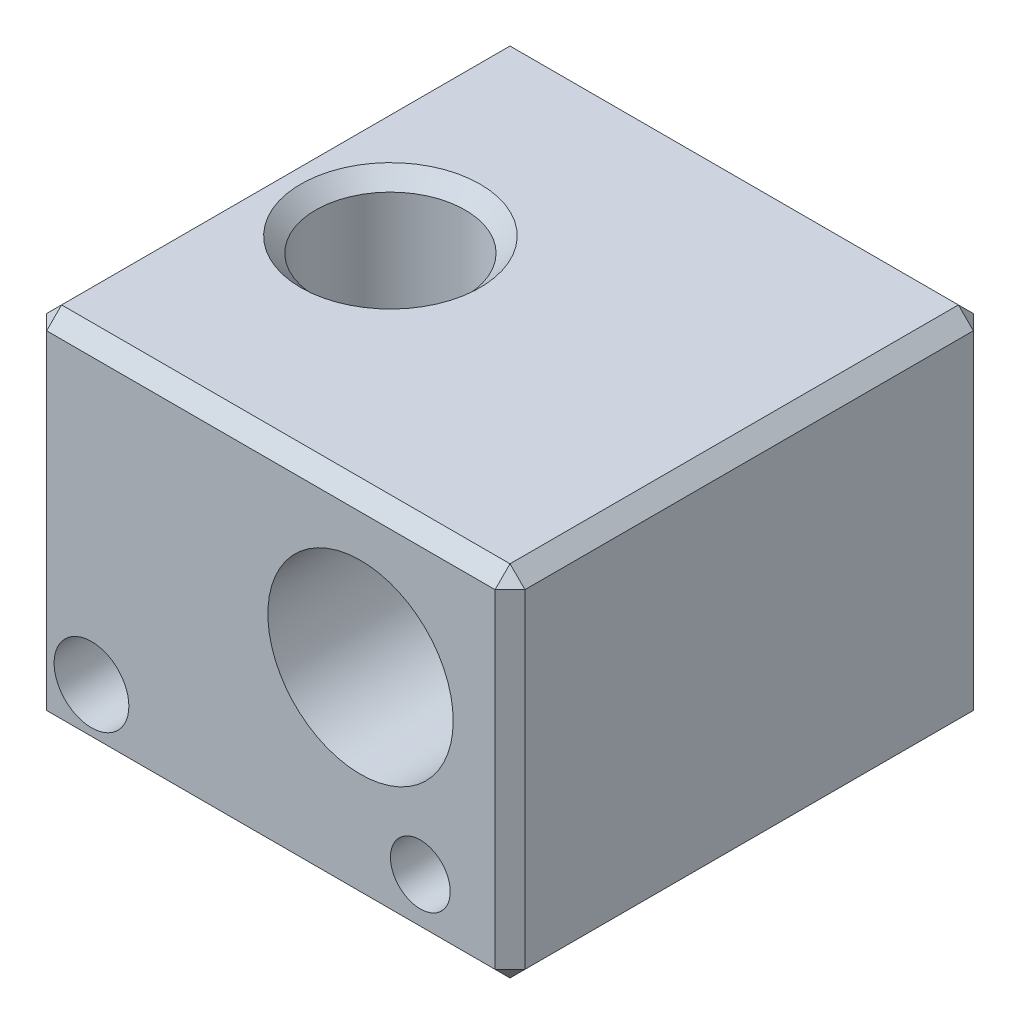
ISO-10303-21;
HEADER;
FILE_DESCRIPTION(('STEP AP214'),'2;1');
FILE_NAME('part.step','',(''),(''),'','','');
FILE_SCHEMA(('AUTOMOTIVE_DESIGN { 1 0 10303 214 1 1 1 1 }'));
ENDSEC;
DATA;
#1=APPLICATION_CONTEXT('core data for automotive mechanical design processes');
#2=APPLICATION_PROTOCOL_DEFINITION('international standard','automotive_design',2000,#1);
#3=PRODUCT_CONTEXT('',#1,'mechanical');
#4=PRODUCT('Part','Part','',(#3));
#5=PRODUCT_RELATED_PRODUCT_CATEGORY('part','',(#4));
#6=PRODUCT_DEFINITION_FORMATION('','',#4);
#7=PRODUCT_DEFINITION_CONTEXT('part definition',#1,'design');
#8=PRODUCT_DEFINITION('design','',#6,#7);
#9=PRODUCT_DEFINITION_SHAPE('','',#8);
#10=(LENGTH_UNIT() NAMED_UNIT(*) SI_UNIT(.MILLI.,.METRE.));
#11=(NAMED_UNIT(*) PLANE_ANGLE_UNIT() SI_UNIT($,.RADIAN.));
#12=(NAMED_UNIT(*) SI_UNIT($,.STERADIAN.) SOLID_ANGLE_UNIT());
#13=UNCERTAINTY_MEASURE_WITH_UNIT(LENGTH_MEASURE(1.E-05),#10,'distance_accuracy_value','');
#14=(GEOMETRIC_REPRESENTATION_CONTEXT(3) GLOBAL_UNCERTAINTY_ASSIGNED_CONTEXT((#13)) GLOBAL_UNIT_ASSIGNED_CONTEXT((#10,
#11,#12)) REPRESENTATION_CONTEXT('',''));
#15=CARTESIAN_POINT('',(0.,0.,0.));
#16=DIRECTION('',(0.,0.,1.));
#17=DIRECTION('',(1.,0.,0.));
#18=AXIS2_PLACEMENT_3D('',#15,#16,#17);
#19=CARTESIAN_POINT('',(-8.,12.,8.));
#20=DIRECTION('',(0.,0.,-1.));
#21=DIRECTION('',(-1.,0.,0.));
#22=AXIS2_PLACEMENT_3D('',#19,#20,#21);
#23=PLANE('',#22);
#24=DIRECTION('',(0.,-1.,0.));
#25=VECTOR('',#24,1.);
#26=CARTESIAN_POINT('',(-7.49999999999999,0.,8.));
#27=LINE('',#26,#25);
#28=CARTESIAN_POINT('',(-7.49999999999999,11.5,8.));
#29=VERTEX_POINT('',#28);
#30=CARTESIAN_POINT('',(-7.49999999999999,0.500000000000004,8.));
#31=VERTEX_POINT('',#30);
#32=EDGE_CURVE('E393',#29,#31,#27,.T.);
#33=ORIENTED_EDGE('',*,*,#32,.T.);
#34=DIRECTION('',(1.,0.,0.));
#35=VECTOR('',#34,1.);
#36=CARTESIAN_POINT('',(-8.,0.500000000000004,8.));
#37=LINE('',#36,#35);
#38=CARTESIAN_POINT('',(7.5,0.500000000000004,8.));
#39=VERTEX_POINT('',#38);
#40=EDGE_CURVE('E403',#31,#39,#37,.T.);
#41=ORIENTED_EDGE('',*,*,#40,.T.);
#42=DIRECTION('',(0.,1.,0.));
#43=VECTOR('',#42,1.);
#44=CARTESIAN_POINT('',(7.5,12.,8.));
#45=LINE('',#44,#43);
#46=CARTESIAN_POINT('',(7.5,11.5,8.));
#47=VERTEX_POINT('',#46);
#48=EDGE_CURVE('E381',#39,#47,#45,.T.);
#49=ORIENTED_EDGE('',*,*,#48,.T.);
#50=DIRECTION('',(-1.,0.,0.));
#51=VECTOR('',#50,1.);
#52=CARTESIAN_POINT('',(-8.,11.5,8.));
#53=LINE('',#52,#51);
#54=EDGE_CURVE('E387',#47,#29,#53,.T.);
#55=ORIENTED_EDGE('',*,*,#54,.T.);
#56=EDGE_LOOP('',(#33,#41,#49,#55));
#57=FACE_BOUND('',#56,.T.);
#58=CARTESIAN_POINT('',(-6.,2.,8.));
#59=DIRECTION('',(0.,0.,1.));
#60=DIRECTION('',(1.,0.,0.));
#61=AXIS2_PLACEMENT_3D('',#58,#59,#60);
#62=CIRCLE('',#61,1.25);
#63=CARTESIAN_POINT('',(-4.75,2.,8.));
#64=VERTEX_POINT('',#63);
#65=EDGE_CURVE('E258',#64,#64,#62,.T.);
#66=ORIENTED_EDGE('',*,*,#65,.F.);
#67=EDGE_LOOP('',(#66));
#68=FACE_BOUND('',#67,.T.);
#69=CARTESIAN_POINT('',(5.,2.,8.));
#70=DIRECTION('',(0.,0.,1.));
#71=DIRECTION('',(1.,0.,0.));
#72=AXIS2_PLACEMENT_3D('',#69,#70,#71);
#73=CIRCLE('',#72,1.);
#74=CARTESIAN_POINT('',(6.,2.,8.));
#75=VERTEX_POINT('',#74);
#76=EDGE_CURVE('E479',#75,#75,#73,.T.);
#77=ORIENTED_EDGE('',*,*,#76,.F.);
#78=EDGE_LOOP('',(#77));
#79=FACE_BOUND('',#78,.T.);
#80=CARTESIAN_POINT('',(3.,7.,8.));
#81=DIRECTION('',(0.,0.,1.));
#82=DIRECTION('',(1.,0.,0.));
#83=AXIS2_PLACEMENT_3D('',#80,#81,#82);
#84=CIRCLE('',#83,3.1);
#85=CARTESIAN_POINT('',(6.1,7.,8.));
#86=VERTEX_POINT('',#85);
#87=EDGE_CURVE('E472',#86,#86,#84,.T.);
#88=ORIENTED_EDGE('',*,*,#87,.F.);
#89=EDGE_LOOP('',(#88));
#90=FACE_BOUND('',#89,.T.);
#91=ADVANCED_FACE('F39',(#57,#68,#79,#90),#23,.F.);
#92=CARTESIAN_POINT('',(8.,12.,8.));
#93=DIRECTION('',(-1.,0.,0.));
#94=DIRECTION('',(0.,0.,1.));
#95=AXIS2_PLACEMENT_3D('',#92,#93,#94);
#96=PLANE('',#95);
#97=DIRECTION('',(0.,0.,1.));
#98=VECTOR('',#97,1.);
#99=CARTESIAN_POINT('',(8.,11.5,8.));
#100=LINE('',#99,#98);
#101=CARTESIAN_POINT('',(8.,11.5,-7.5));
#102=VERTEX_POINT('',#101);
#103=CARTESIAN_POINT('',(8.,11.5,7.5));
#104=VERTEX_POINT('',#103);
#105=EDGE_CURVE('E405',#102,#104,#100,.T.);
#106=ORIENTED_EDGE('',*,*,#105,.T.);
#107=DIRECTION('',(0.,-1.,0.));
#108=VECTOR('',#107,1.);
#109=CARTESIAN_POINT('',(8.,12.,7.5));
#110=LINE('',#109,#108);
#111=CARTESIAN_POINT('',(8.,0.5,7.5));
#112=VERTEX_POINT('',#111);
#113=EDGE_CURVE('E383',#104,#112,#110,.T.);
#114=ORIENTED_EDGE('',*,*,#113,.T.);
#115=DIRECTION('',(0.,0.,-1.));
#116=VECTOR('',#115,1.);
#117=CARTESIAN_POINT('',(8.,0.5,8.));
#118=LINE('',#117,#116);
#119=CARTESIAN_POINT('',(8.,0.5,-7.5));
#120=VERTEX_POINT('',#119);
#121=EDGE_CURVE('E410',#112,#120,#118,.T.);
#122=ORIENTED_EDGE('',*,*,#121,.T.);
#123=DIRECTION('',(0.,1.,0.));
#124=VECTOR('',#123,1.);
#125=CARTESIAN_POINT('',(8.,12.,-7.5));
#126=LINE('',#125,#124);
#127=EDGE_CURVE('E408',#120,#102,#126,.T.);
#128=ORIENTED_EDGE('',*,*,#127,.T.);
#129=EDGE_LOOP('',(#106,#114,#122,#128));
#130=FACE_BOUND('',#129,.T.);
#131=ADVANCED_FACE('F291',(#130),#96,.F.);
#132=CARTESIAN_POINT('',(-8.,12.,-8.));
#133=DIRECTION('',(0.,0.,-1.));
#134=DIRECTION('',(-1.,0.,0.));
#135=AXIS2_PLACEMENT_3D('',#132,#133,#134);
#136=PLANE('',#135);
#137=DIRECTION('',(-1.,0.,0.));
#138=VECTOR('',#137,1.);
#139=CARTESIAN_POINT('',(-8.,0.500000000000004,-8.));
#140=LINE('',#139,#138);
#141=CARTESIAN_POINT('',(7.5,0.500000000000004,-8.));
#142=VERTEX_POINT('',#141);
#143=CARTESIAN_POINT('',(-7.49999999999999,0.500000000000004,-8.));
#144=VERTEX_POINT('',#143);
#145=EDGE_CURVE('E397',#142,#144,#140,.T.);
#146=ORIENTED_EDGE('',*,*,#145,.T.);
#147=DIRECTION('',(0.,1.,0.));
#148=VECTOR('',#147,1.);
#149=CARTESIAN_POINT('',(-7.49999999999999,12.,-8.));
#150=LINE('',#149,#148);
#151=CARTESIAN_POINT('',(-7.49999999999999,11.5,-8.));
#152=VERTEX_POINT('',#151);
#153=EDGE_CURVE('E390',#144,#152,#150,.T.);
#154=ORIENTED_EDGE('',*,*,#153,.T.);
#155=DIRECTION('',(1.,0.,0.));
#156=VECTOR('',#155,1.);
#157=CARTESIAN_POINT('',(-8.,11.5,-8.));
#158=LINE('',#157,#156);
#159=CARTESIAN_POINT('',(7.5,11.5,-8.));
#160=VERTEX_POINT('',#159);
#161=EDGE_CURVE('E430',#152,#160,#158,.T.);
#162=ORIENTED_EDGE('',*,*,#161,.T.);
#163=DIRECTION('',(0.,-1.,0.));
#164=VECTOR('',#163,1.);
#165=CARTESIAN_POINT('',(7.5,0.,-8.));
#166=LINE('',#165,#164);
#167=EDGE_CURVE('E432',#160,#142,#166,.T.);
#168=ORIENTED_EDGE('',*,*,#167,.T.);
#169=EDGE_LOOP('',(#146,#154,#162,#168));
#170=FACE_BOUND('',#169,.T.);
#171=CARTESIAN_POINT('',(5.,2.,-8.));
#172=DIRECTION('',(0.,0.,1.));
#173=DIRECTION('',(1.,0.,0.));
#174=AXIS2_PLACEMENT_3D('',#171,#172,#173);
#175=CIRCLE('',#174,1.);
#176=CARTESIAN_POINT('',(6.,2.,-8.));
#177=VERTEX_POINT('',#176);
#178=EDGE_CURVE('E475',#177,#177,#175,.T.);
#179=ORIENTED_EDGE('',*,*,#178,.T.);
#180=EDGE_LOOP('',(#179));
#181=FACE_BOUND('',#180,.T.);
#182=CARTESIAN_POINT('',(3.,7.,-8.));
#183=DIRECTION('',(0.,0.,1.));
#184=DIRECTION('',(1.,0.,0.));
#185=AXIS2_PLACEMENT_3D('',#182,#183,#184);
#186=CIRCLE('',#185,3.1);
#187=CARTESIAN_POINT('',(6.1,7.,-8.));
#188=VERTEX_POINT('',#187);
#189=EDGE_CURVE('E163',#188,#188,#186,.T.);
#190=ORIENTED_EDGE('',*,*,#189,.T.);
#191=EDGE_LOOP('',(#190));
#192=FACE_BOUND('',#191,.T.);
#193=ADVANCED_FACE('F297',(#170,#181,#192),#136,.T.);
#194=CARTESIAN_POINT('',(-8.,12.,8.));
#195=DIRECTION('',(-1.,0.,0.));
#196=DIRECTION('',(0.,0.,1.));
#197=AXIS2_PLACEMENT_3D('',#194,#195,#196);
#198=PLANE('',#197);
#199=DIRECTION('',(0.,-1.,0.));
#200=VECTOR('',#199,1.);
#201=CARTESIAN_POINT('',(-8.,12.,-7.5));
#202=LINE('',#201,#200);
#203=CARTESIAN_POINT('',(-8.,11.5,-7.5));
#204=VERTEX_POINT('',#203);
#205=CARTESIAN_POINT('',(-8.,0.500000000000004,-7.5));
#206=VERTEX_POINT('',#205);
#207=EDGE_CURVE('E425',#204,#206,#202,.T.);
#208=ORIENTED_EDGE('',*,*,#207,.T.);
#209=DIRECTION('',(0.,0.,1.));
#210=VECTOR('',#209,1.);
#211=CARTESIAN_POINT('',(-8.,0.500000000000004,8.));
#212=LINE('',#211,#210);
#213=CARTESIAN_POINT('',(-8.,0.500000000000004,7.5));
#214=VERTEX_POINT('',#213);
#215=EDGE_CURVE('E169',#206,#214,#212,.T.);
#216=ORIENTED_EDGE('',*,*,#215,.T.);
#217=DIRECTION('',(0.,1.,0.));
#218=VECTOR('',#217,1.);
#219=CARTESIAN_POINT('',(-8.,12.,7.5));
#220=LINE('',#219,#218);
#221=CARTESIAN_POINT('',(-8.,11.5,7.5));
#222=VERTEX_POINT('',#221);
#223=EDGE_CURVE('E443',#214,#222,#220,.T.);
#224=ORIENTED_EDGE('',*,*,#223,.T.);
#225=DIRECTION('',(0.,0.,-1.));
#226=VECTOR('',#225,1.);
#227=CARTESIAN_POINT('',(-8.,11.5,8.));
#228=LINE('',#227,#226);
#229=EDGE_CURVE('E446',#222,#204,#228,.T.);
#230=ORIENTED_EDGE('',*,*,#229,.T.);
#231=EDGE_LOOP('',(#208,#216,#224,#230));
#232=FACE_BOUND('',#231,.T.);
#233=ADVANCED_FACE('F516',(#232),#198,.T.);
#234=CARTESIAN_POINT('',(0.,12.,0.));
#235=DIRECTION('',(0.,1.,0.));
#236=DIRECTION('',(0.,0.,1.));
#237=AXIS2_PLACEMENT_3D('',#234,#235,#236);
#238=PLANE('',#237);
#239=DIRECTION('',(-1.,0.,0.));
#240=VECTOR('',#239,1.);
#241=CARTESIAN_POINT('',(0.,12.,-7.5));
#242=LINE('',#241,#240);
#243=CARTESIAN_POINT('',(7.5,12.,-7.5));
#244=VERTEX_POINT('',#243);
#245=CARTESIAN_POINT('',(-7.5,12.,-7.5));
#246=VERTEX_POINT('',#245);
#247=EDGE_CURVE('E49',#244,#246,#242,.T.);
#248=ORIENTED_EDGE('',*,*,#247,.T.);
#249=DIRECTION('',(0.,0.,1.));
#250=VECTOR('',#249,1.);
#251=CARTESIAN_POINT('',(-7.5,12.,0.));
#252=LINE('',#251,#250);
#253=CARTESIAN_POINT('',(-7.5,12.,7.5));
#254=VERTEX_POINT('',#253);
#255=EDGE_CURVE('E11',#246,#254,#252,.T.);
#256=ORIENTED_EDGE('',*,*,#255,.T.);
#257=DIRECTION('',(1.,0.,0.));
#258=VECTOR('',#257,1.);
#259=CARTESIAN_POINT('',(8.,12.,7.5));
#260=LINE('',#259,#258);
#261=CARTESIAN_POINT('',(7.5,12.,7.5));
#262=VERTEX_POINT('',#261);
#263=EDGE_CURVE('E419',#254,#262,#260,.T.);
#264=ORIENTED_EDGE('',*,*,#263,.T.);
#265=DIRECTION('',(0.,0.,-1.));
#266=VECTOR('',#265,1.);
#267=CARTESIAN_POINT('',(7.5,12.,-8.));
#268=LINE('',#267,#266);
#269=EDGE_CURVE('E60',#262,#244,#268,.T.);
#270=ORIENTED_EDGE('',*,*,#269,.T.);
#271=EDGE_LOOP('',(#248,#256,#264,#270));
#272=FACE_BOUND('',#271,.T.);
#273=CARTESIAN_POINT('',(-4.,12.,0.));
#274=DIRECTION('',(0.,1.,0.));
#275=DIRECTION('',(0.,0.,1.));
#276=AXIS2_PLACEMENT_3D('',#273,#274,#275);
#277=CIRCLE('',#276,2.99999999999999);
#278=CARTESIAN_POINT('',(-4.,12.,2.99999999999999));
#279=VERTEX_POINT('',#278);
#280=EDGE_CURVE('E415',#279,#279,#277,.F.);
#281=ORIENTED_EDGE('',*,*,#280,.T.);
#282=EDGE_LOOP('',(#281));
#283=FACE_BOUND('',#282,.T.);
#284=ADVANCED_FACE('F509',(#272,#283),#238,.T.);
#285=CARTESIAN_POINT('',(0.,0.,0.));
#286=DIRECTION('',(0.,1.,0.));
#287=DIRECTION('',(0.,0.,1.));
#288=AXIS2_PLACEMENT_3D('',#285,#286,#287);
#289=PLANE('',#288);
#290=CARTESIAN_POINT('',(-4.,0.,0.));
#291=DIRECTION('',(0.,1.,0.));
#292=DIRECTION('',(0.,0.,1.));
#293=AXIS2_PLACEMENT_3D('',#290,#291,#292);
#294=CIRCLE('',#293,3.);
#295=CARTESIAN_POINT('',(-4.,0.,3.));
#296=VERTEX_POINT('',#295);
#297=EDGE_CURVE('E459',#296,#296,#294,.T.);
#298=ORIENTED_EDGE('',*,*,#297,.T.);
#299=EDGE_LOOP('',(#298));
#300=FACE_BOUND('',#299,.T.);
#301=CARTESIAN_POINT('',(2.,0.,0.));
#302=DIRECTION('',(0.,1.,0.));
#303=DIRECTION('',(0.,0.,1.));
#304=AXIS2_PLACEMENT_3D('',#301,#302,#303);
#305=CIRCLE('',#304,1.75);
#306=CARTESIAN_POINT('',(2.,0.,1.75));
#307=VERTEX_POINT('',#306);
#308=EDGE_CURVE('E463',#307,#307,#305,.T.);
#309=ORIENTED_EDGE('',*,*,#308,.T.);
#310=EDGE_LOOP('',(#309));
#311=FACE_BOUND('',#310,.T.);
#312=DIRECTION('',(1.,0.,0.));
#313=VECTOR('',#312,1.);
#314=CARTESIAN_POINT('',(8.,0.,-7.5));
#315=LINE('',#314,#313);
#316=CARTESIAN_POINT('',(-7.5,0.,-7.5));
#317=VERTEX_POINT('',#316);
#318=CARTESIAN_POINT('',(7.5,0.,-7.5));
#319=VERTEX_POINT('',#318);
#320=EDGE_CURVE('E143',#317,#319,#315,.T.);
#321=ORIENTED_EDGE('',*,*,#320,.T.);
#322=DIRECTION('',(0.,0.,1.));
#323=VECTOR('',#322,1.);
#324=CARTESIAN_POINT('',(7.5,0.,0.));
#325=LINE('',#324,#323);
#326=CARTESIAN_POINT('',(7.5,0.,7.5));
#327=VERTEX_POINT('',#326);
#328=EDGE_CURVE('E467',#319,#327,#325,.T.);
#329=ORIENTED_EDGE('',*,*,#328,.T.);
#330=DIRECTION('',(-1.,0.,0.));
#331=VECTOR('',#330,1.);
#332=CARTESIAN_POINT('',(0.,0.,7.5));
#333=LINE('',#332,#331);
#334=CARTESIAN_POINT('',(-7.5,0.,7.5));
#335=VERTEX_POINT('',#334);
#336=EDGE_CURVE('E145',#327,#335,#333,.T.);
#337=ORIENTED_EDGE('',*,*,#336,.T.);
#338=DIRECTION('',(0.,0.,-1.));
#339=VECTOR('',#338,1.);
#340=CARTESIAN_POINT('',(-7.5,0.,-8.));
#341=LINE('',#340,#339);
#342=EDGE_CURVE('E139',#335,#317,#341,.T.);
#343=ORIENTED_EDGE('',*,*,#342,.T.);
#344=EDGE_LOOP('',(#321,#329,#337,#343));
#345=FACE_BOUND('',#344,.T.);
#346=ADVANCED_FACE('F141',(#300,#311,#345),#289,.F.);
#347=CARTESIAN_POINT('',(3.,7.,-8.));
#348=DIRECTION('',(0.,0.,1.));
#349=DIRECTION('',(1.,0.,0.));
#350=AXIS2_PLACEMENT_3D('',#347,#348,#349);
#351=CYLINDRICAL_SURFACE('',#350,3.1);
#352=CARTESIAN_POINT('',(2.,4.06571984977576,-1.25));
#353=CARTESIAN_POINT('',(2.06412407102761,4.04386931657047,-1.24999682356544));
#354=CARTESIAN_POINT('',(2.1290323605544,4.02411324985325,-1.24504633684303));
#355=CARTESIAN_POINT('',(2.25852514450525,3.98923249124023,-1.22473081712279));
#356=CARTESIAN_POINT('',(2.32310928391037,3.97411209996811,-1.20935615557821));
#357=CARTESIAN_POINT('',(2.44989951240688,3.94851243111399,-1.16813357100094));
#358=CARTESIAN_POINT('',(2.5121031224863,3.93803787752112,-1.14227503862974));
#359=CARTESIAN_POINT('',(2.63195571275444,3.92132984840443,-1.08059009030169));
#360=CARTESIAN_POINT('',(2.68960522979696,3.9150958723238,-1.04476485151625));
#361=CARTESIAN_POINT('',(2.79749646548957,3.9061553785297,-0.964844569883464));
#362=CARTESIAN_POINT('',(2.84785468706466,3.90338624247298,-0.920913307988026));
#363=CARTESIAN_POINT('',(2.94096515404917,3.9002113379841,-0.825546991201818));
#364=CARTESIAN_POINT('',(2.98371611790489,3.89980596739803,-0.77411067462625));
#365=CARTESIAN_POINT('',(3.06159260293196,3.90035946609992,-0.663497060760644));
#366=CARTESIAN_POINT('',(3.09645925371717,3.90135848340574,-0.604137697597038));
#367=CARTESIAN_POINT('',(3.15599100394901,3.90378325578923,-0.48051332323618));
#368=CARTESIAN_POINT('',(3.18065507855612,3.90520905371185,-0.41624781998927));
#369=CARTESIAN_POINT('',(3.219563460487,3.90772172802315,-0.283004227305716));
#370=CARTESIAN_POINT('',(3.23355335949016,3.90879999521813,-0.213951486933704));
#371=CARTESIAN_POINT('',(3.24975342466547,3.91006624436077,-0.0744708002820152));
#372=CARTESIAN_POINT('',(3.25196372633312,3.91025423654886,-0.0040428698298939));
#373=CARTESIAN_POINT('',(3.24454584579713,3.90965852729883,0.13610331981758));
#374=CARTESIAN_POINT('',(3.23493084752302,3.90887590797932,0.205822282120605));
#375=CARTESIAN_POINT('',(3.20416096316388,3.90669215451381,0.342658473349358));
#376=CARTESIAN_POINT('',(3.18300525336871,3.90529097621996,0.409775516198639));
#377=CARTESIAN_POINT('',(3.12971705925274,3.90260076032698,0.539600864597366));
#378=CARTESIAN_POINT('',(3.09757104261829,3.90131186344619,0.602303619527018));
#379=CARTESIAN_POINT('',(3.02320544748315,3.89986461575388,0.721443742705734));
#380=CARTESIAN_POINT('',(2.98098576274907,3.89970627686539,0.777881044872323));
#381=CARTESIAN_POINT('',(2.88783342606414,3.90168164861602,0.882695629692789));
#382=CARTESIAN_POINT('',(2.83692789470841,3.90380833082803,0.931097102225148));
#383=CARTESIAN_POINT('',(2.72789903274865,3.91148275042813,1.01859946114047));
#384=CARTESIAN_POINT('',(2.6697779427384,3.91702942794207,1.0577032237314));
#385=CARTESIAN_POINT('',(2.55012644860688,3.93224260272356,1.12446031488305));
#386=CARTESIAN_POINT('',(2.48875355593523,3.9417786318946,1.15242580114432));
#387=CARTESIAN_POINT('',(2.36312125667163,3.96545446304068,1.19795912574914));
#388=CARTESIAN_POINT('',(2.29886232190712,3.97959351483077,1.21552865707629));
#389=CARTESIAN_POINT('',(2.17069358533456,4.01226682493206,1.23997912488614));
#390=CARTESIAN_POINT('',(2.10679724119453,4.03072012533362,1.24704113706527));
#391=CARTESIAN_POINT('',(1.98004597127627,4.07183711455998,1.25145005951004));
#392=CARTESIAN_POINT('',(1.91719133547124,4.09450195497261,1.24879430886528));
#393=CARTESIAN_POINT('',(1.79039996352613,4.14486637335437,1.23404889696496));
#394=CARTESIAN_POINT('',(1.72661340015781,4.17278229677925,1.22141881599695));
#395=CARTESIAN_POINT('',(1.60309462789989,4.23172480365729,1.18704722608764));
#396=CARTESIAN_POINT('',(1.54336344063695,4.26275216610093,1.16530343105146));
#397=CARTESIAN_POINT('',(1.42117063361051,4.33113821293562,1.11019217671031));
#398=CARTESIAN_POINT('',(1.35939678232038,4.36879094402457,1.07566592104613));
#399=CARTESIAN_POINT('',(1.24282899693574,4.4451575339971,0.997068324896723));
#400=CARTESIAN_POINT('',(1.18804788503108,4.48387318839118,0.952979839015347));
#401=CARTESIAN_POINT('',(1.07981131798573,4.5652493581044,0.84973208913941));
#402=CARTESIAN_POINT('',(1.02740262887541,4.60778841664885,0.78937125648153));
#403=CARTESIAN_POINT('',(0.933940511899614,4.68803781259185,0.657652699139252));
#404=CARTESIAN_POINT('',(0.892858403867074,4.72576021366949,0.58632347533955));
#405=CARTESIAN_POINT('',(0.837584924562768,4.77855333774515,0.462557639917995));
#406=CARTESIAN_POINT('',(0.819123133548135,4.79676287087563,0.413367344271981));
#407=CARTESIAN_POINT('',(0.78826980528795,4.82773679133903,0.311499179493662));
#408=CARTESIAN_POINT('',(0.77586854424242,4.84050989685295,0.25882705197902));
#409=CARTESIAN_POINT('',(0.757881546309418,4.85918640303962,0.150576807086338));
#410=CARTESIAN_POINT('',(0.752359461653582,4.86502562241385,0.0949764403431551));
#411=CARTESIAN_POINT('',(0.748865472828148,4.86870869109976,-0.0167257193774438));
#412=CARTESIAN_POINT('',(0.75089069399976,4.86655558457313,-0.0728273133239362));
#413=CARTESIAN_POINT('',(0.761578516592351,4.85535245667867,-0.176640207564639));
#414=CARTESIAN_POINT('',(0.769401951034631,4.84717513891782,-0.224540654398175));
#415=CARTESIAN_POINT('',(0.790189830408191,4.82584267352125,-0.318052868932751));
#416=CARTESIAN_POINT('',(0.803158016152508,4.81268390412906,-0.363662944029742));
#417=CARTESIAN_POINT('',(0.840162649243759,4.77603236941032,-0.470880626168048));
#418=CARTESIAN_POINT('',(0.866560750198721,4.75052707780665,-0.530981431141114));
#419=CARTESIAN_POINT('',(0.927112096806266,4.69460608468315,-0.644654810619277));
#420=CARTESIAN_POINT('',(0.96128358816086,4.66417887978581,-0.698211562882469));
#421=CARTESIAN_POINT('',(1.04663268271053,4.59204167799534,-0.812383187083013));
#422=CARTESIAN_POINT('',(1.09990535564506,4.54952185264107,-0.870922323350582));
#423=CARTESIAN_POINT('',(1.21609478271498,4.46368107503741,-0.976818044097293));
#424=CARTESIAN_POINT('',(1.27901991633881,4.42035945574847,-1.02416482064182));
#425=CARTESIAN_POINT('',(1.41392776615344,4.33527163579194,-1.10694157287936));
#426=CARTESIAN_POINT('',(1.48596282556899,4.29351639302137,-1.14229794759976));
#427=CARTESIAN_POINT('',(1.63734346211578,4.21424966883542,-1.19894283194074));
#428=CARTESIAN_POINT('',(1.71666261513442,4.17672386857871,-1.22028006615794));
#429=CARTESIAN_POINT('',(1.83136793930619,4.12848715119251,-1.23902278442863));
#430=CARTESIAN_POINT('',(1.86466000756247,4.11516072866024,-1.2431091379948));
#431=CARTESIAN_POINT('',(1.93189370742814,4.08959773467645,-1.24859903306798));
#432=CARTESIAN_POINT('',(1.96583554893592,4.07736152287063,-1.25000169236203));
#433=CARTESIAN_POINT('',(2.,4.06571984977576,-1.25));
#434=B_SPLINE_CURVE_WITH_KNOTS('',3,(#352,#353,#354,#355,#356,#357,#358,#359,#360,#361,#362,
#363,#364,#365,#366,#367,#368,#369,#370,#371,#372,#373,#374,#375,#376,#377,#378,#379,#380,#381,
#382,#383,#384,#385,#386,#387,#388,#389,#390,#391,#392,#393,#394,#395,#396,#397,#398,#399,#400,
#401,#402,#403,#404,#405,#406,#407,#408,#409,#410,#411,#412,#413,#414,#415,#416,#417,#418,#419,
#420,#421,#422,#423,#424,#425,#426,#427,#428,#429,#430,#431,#432,#433),.UNSPECIFIED.,.T.,.F.,(4,
2,2,2,2,2,2,2,2,2,2,2,2,2,2,2,2,2,2,2,2,2,2,2,2,2,2,2,2,2,2,2,2,2,2,2,2,2,2,2,4),(0.,
0.203106901637013,0.406401664025732,0.609902669700279,0.813379649991945,1.01312353075626,
1.21290102950349,1.41850722043965,1.62413405931888,1.83452067354489,2.04490486778157,
2.25505471888995,2.46521957125866,2.67564413620872,2.88607092032087,3.09585230705912,
3.30556871411916,3.50890505804192,3.71220827947522,3.91196568210335,4.11177778624364,
4.32322687709546,4.53472903986192,4.77426968848165,5.01424344552382,5.28461256836008,
5.55429066399378,5.72053905381196,5.88651982393155,6.05402525513779,6.22146689248854,
6.36849795003851,6.51563611222958,6.72574116876292,6.93634456763189,7.20454767246493,
7.47298494124712,7.74304134015153,8.01215410127126,8.120331198527,8.2285438508205),.UNSPECIFIED.);
#435=CARTESIAN_POINT('',(2.,4.06571984977576,-1.25));
#436=VERTEX_POINT('',#435);
#437=EDGE_CURVE('E250',#436,#436,#434,.T.);
#438=ORIENTED_EDGE('',*,*,#437,.T.);
#439=EDGE_LOOP('',(#438));
#440=FACE_BOUND('',#439,.T.);
#441=ORIENTED_EDGE('',*,*,#189,.F.);
#442=EDGE_LOOP('',(#441));
#443=FACE_BOUND('',#442,.T.);
#444=ORIENTED_EDGE('',*,*,#87,.T.);
#445=EDGE_LOOP('',(#444));
#446=FACE_BOUND('',#445,.T.);
#447=ADVANCED_FACE('F499',(#440,#443,#446),#351,.F.);
#448=CARTESIAN_POINT('',(5.,2.,-8.));
#449=DIRECTION('',(0.,0.,1.));
#450=DIRECTION('',(1.,0.,0.));
#451=AXIS2_PLACEMENT_3D('',#448,#449,#450);
#452=CYLINDRICAL_SURFACE('',#451,1.);
#453=ORIENTED_EDGE('',*,*,#178,.F.);
#454=EDGE_LOOP('',(#453));
#455=FACE_BOUND('',#454,.T.);
#456=ORIENTED_EDGE('',*,*,#76,.T.);
#457=EDGE_LOOP('',(#456));
#458=FACE_BOUND('',#457,.T.);
#459=ADVANCED_FACE('F501',(#455,#458),#452,.F.);
#460=CARTESIAN_POINT('',(-6.,2.,3.5));
#461=DIRECTION('',(0.,0.,-1.));
#462=DIRECTION('',(-1.,0.,0.));
#463=AXIS2_PLACEMENT_3D('',#460,#461,#462);
#464=PLANE('',#463);
#465=CARTESIAN_POINT('',(-6.,2.,3.5));
#466=DIRECTION('',(0.,0.,1.));
#467=DIRECTION('',(1.,0.,0.));
#468=AXIS2_PLACEMENT_3D('',#465,#466,#467);
#469=CIRCLE('',#468,1.25);
#470=CARTESIAN_POINT('',(-4.75,2.,3.5));
#471=VERTEX_POINT('',#470);
#472=EDGE_CURVE('E264',#471,#471,#469,.T.);
#473=ORIENTED_EDGE('',*,*,#472,.T.);
#474=EDGE_LOOP('',(#473));
#475=FACE_BOUND('',#474,.T.);
#476=ADVANCED_FACE('F488',(#475),#464,.F.);
#477=CARTESIAN_POINT('',(-6.,2.,8.));
#478=DIRECTION('',(0.,0.,1.));
#479=DIRECTION('',(1.,0.,0.));
#480=AXIS2_PLACEMENT_3D('',#477,#478,#479);
#481=CYLINDRICAL_SURFACE('',#480,1.25);
#482=ORIENTED_EDGE('',*,*,#472,.F.);
#483=EDGE_LOOP('',(#482));
#484=FACE_BOUND('',#483,.T.);
#485=ORIENTED_EDGE('',*,*,#65,.T.);
#486=EDGE_LOOP('',(#485));
#487=FACE_BOUND('',#486,.T.);
#488=ADVANCED_FACE('F286',(#484,#487),#481,.F.);
#489=CARTESIAN_POINT('',(-4.,12.,0.));
#490=DIRECTION('',(0.,1.,0.));
#491=DIRECTION('',(0.,0.,1.));
#492=AXIS2_PLACEMENT_3D('',#489,#490,#491);
#493=CYLINDRICAL_SURFACE('',#492,2.49999999999999);
#494=CARTESIAN_POINT('',(-4.,0.500000000000007,0.));
#495=DIRECTION('',(0.,1.,0.));
#496=DIRECTION('',(0.,0.,1.));
#497=AXIS2_PLACEMENT_3D('',#494,#495,#496);
#498=CIRCLE('',#497,2.49999999999999);
#499=CARTESIAN_POINT('',(-4.,0.500000000000007,2.49999999999999));
#500=VERTEX_POINT('',#499);
#501=EDGE_CURVE('E452',#500,#500,#498,.F.);
#502=ORIENTED_EDGE('',*,*,#501,.T.);
#503=EDGE_LOOP('',(#502));
#504=FACE_BOUND('',#503,.T.);
#505=CARTESIAN_POINT('',(-4.,11.5,0.));
#506=DIRECTION('',(0.,1.,0.));
#507=DIRECTION('',(0.,0.,1.));
#508=AXIS2_PLACEMENT_3D('',#505,#506,#507);
#509=CIRCLE('',#508,2.49999999999999);
#510=CARTESIAN_POINT('',(-4.,11.5,2.49999999999999));
#511=VERTEX_POINT('',#510);
#512=EDGE_CURVE('E455',#511,#511,#509,.T.);
#513=ORIENTED_EDGE('',*,*,#512,.T.);
#514=EDGE_LOOP('',(#513));
#515=FACE_BOUND('',#514,.T.);
#516=ADVANCED_FACE('F277',(#504,#515),#493,.F.);
#517=CARTESIAN_POINT('',(2.,0.,0.));
#518=DIRECTION('',(0.,-1.,0.));
#519=DIRECTION('',(0.,0.,-1.));
#520=AXIS2_PLACEMENT_3D('',#517,#518,#519);
#521=CYLINDRICAL_SURFACE('',#520,1.25);
#522=CARTESIAN_POINT('',(2.,0.499999999999996,0.));
#523=DIRECTION('',(0.,1.,0.));
#524=DIRECTION('',(0.,0.,1.));
#525=AXIS2_PLACEMENT_3D('',#522,#523,#524);
#526=CIRCLE('',#525,1.25);
#527=CARTESIAN_POINT('',(2.,0.499999999999996,1.25));
#528=VERTEX_POINT('',#527);
#529=EDGE_CURVE('E449',#528,#528,#526,.F.);
#530=ORIENTED_EDGE('',*,*,#529,.T.);
#531=EDGE_LOOP('',(#530));
#532=FACE_BOUND('',#531,.T.);
#533=ORIENTED_EDGE('',*,*,#437,.F.);
#534=EDGE_LOOP('',(#533));
#535=FACE_BOUND('',#534,.T.);
#536=ADVANCED_FACE('F273',(#532,#535),#521,.F.);
#537=CARTESIAN_POINT('',(-4.,0.,0.));
#538=DIRECTION('',(0.,-1.,0.));
#539=DIRECTION('',(0.,0.,-1.));
#540=AXIS2_PLACEMENT_3D('',#537,#538,#539);
#541=CONICAL_SURFACE('',#540,3.,0.785398163397445);
#542=ORIENTED_EDGE('',*,*,#501,.F.);
#543=EDGE_LOOP('',(#542));
#544=FACE_BOUND('',#543,.T.);
#545=ORIENTED_EDGE('',*,*,#297,.F.);
#546=EDGE_LOOP('',(#545));
#547=FACE_BOUND('',#546,.T.);
#548=ADVANCED_FACE('F276',(#544,#547),#541,.F.);
#549=CARTESIAN_POINT('',(2.,0.499999999999996,0.));
#550=DIRECTION('',(0.,-1.,0.));
#551=DIRECTION('',(0.,0.,-1.));
#552=AXIS2_PLACEMENT_3D('',#549,#550,#551);
#553=CONICAL_SURFACE('',#552,1.25,0.785398163397451);
#554=ORIENTED_EDGE('',*,*,#308,.F.);
#555=EDGE_LOOP('',(#554));
#556=FACE_BOUND('',#555,.T.);
#557=ORIENTED_EDGE('',*,*,#529,.F.);
#558=EDGE_LOOP('',(#557));
#559=FACE_BOUND('',#558,.T.);
#560=ADVANCED_FACE('F283',(#556,#559),#553,.F.);
#561=CARTESIAN_POINT('',(8.,12.,7.5));
#562=DIRECTION('',(-0.707106781186545,0.,-0.70710678118655));
#563=DIRECTION('',(0.,-1.,0.));
#564=AXIS2_PLACEMENT_3D('',#561,#562,#563);
#565=PLANE('',#564);
#566=DIRECTION('',(-0.70710678118655,0.,0.707106781186545));
#567=VECTOR('',#566,1.);
#568=CARTESIAN_POINT('',(7.5,11.5,8.));
#569=LINE('',#568,#567);
#570=EDGE_CURVE('E43',#47,#104,#569,.F.);
#571=ORIENTED_EDGE('',*,*,#570,.F.);
#572=ORIENTED_EDGE('',*,*,#48,.F.);
#573=DIRECTION('',(0.70710678118655,0.,-0.707106781186545));
#574=VECTOR('',#573,1.);
#575=CARTESIAN_POINT('',(8.,0.5,7.5));
#576=LINE('',#575,#574);
#577=EDGE_CURVE('E240',#112,#39,#576,.F.);
#578=ORIENTED_EDGE('',*,*,#577,.F.);
#579=ORIENTED_EDGE('',*,*,#113,.F.);
#580=EDGE_LOOP('',(#571,#572,#578,#579));
#581=FACE_BOUND('',#580,.T.);
#582=ADVANCED_FACE('F306',(#581),#565,.F.);
#583=CARTESIAN_POINT('',(7.5,11.5,8.));
#584=DIRECTION('',(0.577350269189626,0.577350269189622,0.57735026918963));
#585=DIRECTION('',(0.70710678118655,0.,-0.707106781186545));
#586=AXIS2_PLACEMENT_3D('',#583,#584,#585);
#587=PLANE('',#586);
#588=DIRECTION('',(0.,-0.70710678118655,0.707106781186545));
#589=VECTOR('',#588,1.);
#590=CARTESIAN_POINT('',(7.5,11.5,8.));
#591=LINE('',#590,#589);
#592=EDGE_CURVE('E233',#47,#262,#591,.F.);
#593=ORIENTED_EDGE('',*,*,#592,.F.);
#594=ORIENTED_EDGE('',*,*,#570,.T.);
#595=DIRECTION('',(-0.707106781186545,0.70710678118655,0.));
#596=VECTOR('',#595,1.);
#597=CARTESIAN_POINT('',(7.75,11.75,7.5));
#598=LINE('',#597,#596);
#599=EDGE_CURVE('E237',#262,#104,#598,.F.);
#600=ORIENTED_EDGE('',*,*,#599,.F.);
#601=EDGE_LOOP('',(#593,#594,#600));
#602=FACE_BOUND('',#601,.T.);
#603=ADVANCED_FACE('F373',(#602),#587,.T.);
#604=CARTESIAN_POINT('',(8.,0.5,7.5));
#605=DIRECTION('',(0.577350269189622,-0.577350269189626,0.57735026918963));
#606=DIRECTION('',(0.,-0.70710678118655,-0.707106781186545));
#607=AXIS2_PLACEMENT_3D('',#604,#605,#606);
#608=PLANE('',#607);
#609=DIRECTION('',(-0.70710678118655,-0.707106781186545,0.));
#610=VECTOR('',#609,1.);
#611=CARTESIAN_POINT('',(8.,0.5,7.5));
#612=LINE('',#611,#610);
#613=EDGE_CURVE('E225',#112,#327,#612,.T.);
#614=ORIENTED_EDGE('',*,*,#613,.F.);
#615=ORIENTED_EDGE('',*,*,#577,.T.);
#616=DIRECTION('',(0.,0.70710678118655,0.707106781186545));
#617=VECTOR('',#616,1.);
#618=CARTESIAN_POINT('',(7.5,0.250000000000002,7.75));
#619=LINE('',#618,#617);
#620=EDGE_CURVE('E229',#327,#39,#619,.T.);
#621=ORIENTED_EDGE('',*,*,#620,.F.);
#622=EDGE_LOOP('',(#614,#615,#621));
#623=FACE_BOUND('',#622,.T.);
#624=ADVANCED_FACE('F369',(#623),#608,.T.);
#625=CARTESIAN_POINT('',(7.5,12.,0.));
#626=DIRECTION('',(0.70710678118655,0.707106781186545,0.));
#627=DIRECTION('',(0.,0.,1.));
#628=AXIS2_PLACEMENT_3D('',#625,#626,#627);
#629=PLANE('',#628);
#630=ORIENTED_EDGE('',*,*,#599,.T.);
#631=ORIENTED_EDGE('',*,*,#105,.F.);
#632=DIRECTION('',(0.707106781186545,-0.70710678118655,0.));
#633=VECTOR('',#632,1.);
#634=CARTESIAN_POINT('',(8.,11.5,-7.5));
#635=LINE('',#634,#633);
#636=EDGE_CURVE('E219',#244,#102,#635,.T.);
#637=ORIENTED_EDGE('',*,*,#636,.F.);
#638=ORIENTED_EDGE('',*,*,#269,.F.);
#639=EDGE_LOOP('',(#630,#631,#637,#638));
#640=FACE_BOUND('',#639,.T.);
#641=ADVANCED_FACE('F365',(#640),#629,.T.);
#642=CARTESIAN_POINT('',(0.,12.,7.5));
#643=DIRECTION('',(0.,0.707106781186545,0.70710678118655));
#644=DIRECTION('',(-1.,0.,0.));
#645=AXIS2_PLACEMENT_3D('',#642,#643,#644);
#646=PLANE('',#645);
#647=ORIENTED_EDGE('',*,*,#592,.T.);
#648=ORIENTED_EDGE('',*,*,#263,.F.);
#649=DIRECTION('',(0.,0.70710678118655,-0.707106781186545));
#650=VECTOR('',#649,1.);
#651=CARTESIAN_POINT('',(-7.5,11.75,7.75));
#652=LINE('',#651,#650);
#653=EDGE_CURVE('E215',#29,#254,#652,.T.);
#654=ORIENTED_EDGE('',*,*,#653,.F.);
#655=ORIENTED_EDGE('',*,*,#54,.F.);
#656=EDGE_LOOP('',(#647,#648,#654,#655));
#657=FACE_BOUND('',#656,.T.);
#658=ADVANCED_FACE('F361',(#657),#646,.T.);
#659=CARTESIAN_POINT('',(-7.49999999999999,12.,8.));
#660=DIRECTION('',(-0.707106781186545,0.,0.70710678118655));
#661=DIRECTION('',(0.,1.,0.));
#662=AXIS2_PLACEMENT_3D('',#659,#660,#661);
#663=PLANE('',#662);
#664=DIRECTION('',(-0.70710678118655,0.,-0.707106781186545));
#665=VECTOR('',#664,1.);
#666=CARTESIAN_POINT('',(-7.49999999999999,0.500000000000004,8.));
#667=LINE('',#666,#665);
#668=EDGE_CURVE('E208',#31,#214,#667,.T.);
#669=ORIENTED_EDGE('',*,*,#668,.F.);
#670=ORIENTED_EDGE('',*,*,#32,.F.);
#671=DIRECTION('',(0.70710678118655,0.,0.707106781186545));
#672=VECTOR('',#671,1.);
#673=CARTESIAN_POINT('',(-8.,11.5,7.5));
#674=LINE('',#673,#672);
#675=EDGE_CURVE('E211',#222,#29,#674,.T.);
#676=ORIENTED_EDGE('',*,*,#675,.F.);
#677=ORIENTED_EDGE('',*,*,#223,.F.);
#678=EDGE_LOOP('',(#669,#670,#676,#677));
#679=FACE_BOUND('',#678,.T.);
#680=ADVANCED_FACE('F357',(#679),#663,.T.);
#681=CARTESIAN_POINT('',(-8.,0.500000000000004,8.));
#682=DIRECTION('',(0.,0.707106781186545,-0.70710678118655));
#683=DIRECTION('',(1.,0.,0.));
#684=AXIS2_PLACEMENT_3D('',#681,#682,#683);
#685=PLANE('',#684);
#686=ORIENTED_EDGE('',*,*,#620,.T.);
#687=ORIENTED_EDGE('',*,*,#40,.F.);
#688=DIRECTION('',(0.,-0.70710678118655,-0.707106781186545));
#689=VECTOR('',#688,1.);
#690=CARTESIAN_POINT('',(-7.49999999999999,0.500000000000004,8.));
#691=LINE('',#690,#689);
#692=EDGE_CURVE('E206',#335,#31,#691,.F.);
#693=ORIENTED_EDGE('',*,*,#692,.F.);
#694=ORIENTED_EDGE('',*,*,#336,.F.);
#695=EDGE_LOOP('',(#686,#687,#693,#694));
#696=FACE_BOUND('',#695,.T.);
#697=ADVANCED_FACE('F353',(#696),#685,.F.);
#698=CARTESIAN_POINT('',(8.,0.5,8.));
#699=DIRECTION('',(-0.707106781186545,0.70710678118655,0.));
#700=DIRECTION('',(0.,0.,-1.));
#701=AXIS2_PLACEMENT_3D('',#698,#699,#700);
#702=PLANE('',#701);
#703=ORIENTED_EDGE('',*,*,#613,.T.);
#704=ORIENTED_EDGE('',*,*,#328,.F.);
#705=DIRECTION('',(0.70710678118655,0.707106781186545,0.));
#706=VECTOR('',#705,1.);
#707=CARTESIAN_POINT('',(8.,0.5,-7.5));
#708=LINE('',#707,#706);
#709=EDGE_CURVE('E203',#120,#319,#708,.F.);
#710=ORIENTED_EDGE('',*,*,#709,.F.);
#711=ORIENTED_EDGE('',*,*,#121,.F.);
#712=EDGE_LOOP('',(#703,#704,#710,#711));
#713=FACE_BOUND('',#712,.T.);
#714=ADVANCED_FACE('F349',(#713),#702,.F.);
#715=CARTESIAN_POINT('',(7.5,12.,-8.));
#716=DIRECTION('',(0.70710678118655,0.,-0.707106781186545));
#717=DIRECTION('',(0.,1.,0.));
#718=AXIS2_PLACEMENT_3D('',#715,#716,#717);
#719=PLANE('',#718);
#720=DIRECTION('',(-0.707106781186545,0.,-0.70710678118655));
#721=VECTOR('',#720,1.);
#722=CARTESIAN_POINT('',(8.,11.5,-7.5));
#723=LINE('',#722,#721);
#724=EDGE_CURVE('E222',#102,#160,#723,.T.);
#725=ORIENTED_EDGE('',*,*,#724,.F.);
#726=ORIENTED_EDGE('',*,*,#127,.F.);
#727=DIRECTION('',(0.707106781186545,0.,0.70710678118655));
#728=VECTOR('',#727,1.);
#729=CARTESIAN_POINT('',(8.,0.5,-7.5));
#730=LINE('',#729,#728);
#731=EDGE_CURVE('E200',#142,#120,#730,.T.);
#732=ORIENTED_EDGE('',*,*,#731,.F.);
#733=ORIENTED_EDGE('',*,*,#167,.F.);
#734=EDGE_LOOP('',(#725,#726,#732,#733));
#735=FACE_BOUND('',#734,.T.);
#736=ADVANCED_FACE('F345',(#735),#719,.T.);
#737=CARTESIAN_POINT('',(8.,11.5,-7.5));
#738=DIRECTION('',(0.57735026918963,0.577350269189622,-0.577350269189626));
#739=DIRECTION('',(-0.707106781186545,0.,-0.70710678118655));
#740=AXIS2_PLACEMENT_3D('',#737,#738,#739);
#741=PLANE('',#740);
#742=ORIENTED_EDGE('',*,*,#636,.T.);
#743=ORIENTED_EDGE('',*,*,#724,.T.);
#744=DIRECTION('',(0.,-0.70710678118655,-0.707106781186545));
#745=VECTOR('',#744,1.);
#746=CARTESIAN_POINT('',(7.5,11.75,-7.75));
#747=LINE('',#746,#745);
#748=EDGE_CURVE('E197',#244,#160,#747,.T.);
#749=ORIENTED_EDGE('',*,*,#748,.F.);
#750=EDGE_LOOP('',(#742,#743,#749));
#751=FACE_BOUND('',#750,.T.);
#752=ADVANCED_FACE('F341',(#751),#741,.T.);
#753=CARTESIAN_POINT('',(-8.,11.5,7.5));
#754=DIRECTION('',(-0.577350269189626,0.577350269189622,0.57735026918963));
#755=DIRECTION('',(0.70710678118655,0.,0.707106781186545));
#756=AXIS2_PLACEMENT_3D('',#753,#754,#755);
#757=PLANE('',#756);
#758=ORIENTED_EDGE('',*,*,#675,.T.);
#759=ORIENTED_EDGE('',*,*,#653,.T.);
#760=DIRECTION('',(0.707106781186545,0.70710678118655,0.));
#761=VECTOR('',#760,1.);
#762=CARTESIAN_POINT('',(-8.,11.5,7.5));
#763=LINE('',#762,#761);
#764=EDGE_CURVE('E194',#222,#254,#763,.T.);
#765=ORIENTED_EDGE('',*,*,#764,.F.);
#766=EDGE_LOOP('',(#758,#759,#765));
#767=FACE_BOUND('',#766,.T.);
#768=ADVANCED_FACE('F337',(#767),#757,.T.);
#769=CARTESIAN_POINT('',(-7.49999999999999,0.500000000000004,8.));
#770=DIRECTION('',(-0.577350269189626,-0.577350269189622,0.57735026918963));
#771=DIRECTION('',(0.70710678118655,0.,0.707106781186545));
#772=AXIS2_PLACEMENT_3D('',#769,#770,#771);
#773=PLANE('',#772);
#774=ORIENTED_EDGE('',*,*,#692,.T.);
#775=ORIENTED_EDGE('',*,*,#668,.T.);
#776=DIRECTION('',(0.707106781186545,-0.70710678118655,0.));
#777=VECTOR('',#776,1.);
#778=CARTESIAN_POINT('',(-7.75,0.250000000000002,7.5));
#779=LINE('',#778,#777);
#780=EDGE_CURVE('E192',#335,#214,#779,.F.);
#781=ORIENTED_EDGE('',*,*,#780,.F.);
#782=EDGE_LOOP('',(#774,#775,#781));
#783=FACE_BOUND('',#782,.T.);
#784=ADVANCED_FACE('F333',(#783),#773,.T.);
#785=CARTESIAN_POINT('',(8.,0.5,-7.5));
#786=DIRECTION('',(0.577350269189626,-0.577350269189626,-0.577350269189626));
#787=DIRECTION('',(-0.707106781186548,0.,-0.707106781186547));
#788=AXIS2_PLACEMENT_3D('',#785,#786,#787);
#789=PLANE('',#788);
#790=ORIENTED_EDGE('',*,*,#731,.T.);
#791=ORIENTED_EDGE('',*,*,#709,.T.);
#792=DIRECTION('',(0.,0.70710678118655,-0.707106781186545));
#793=VECTOR('',#792,1.);
#794=CARTESIAN_POINT('',(7.5,0.250000000000002,-7.75));
#795=LINE('',#794,#793);
#796=EDGE_CURVE('E161',#142,#319,#795,.F.);
#797=ORIENTED_EDGE('',*,*,#796,.F.);
#798=EDGE_LOOP('',(#790,#791,#797));
#799=FACE_BOUND('',#798,.T.);
#800=ADVANCED_FACE('F329',(#799),#789,.T.);
#801=CARTESIAN_POINT('',(-8.,11.5,-8.));
#802=DIRECTION('',(0.,-0.707106781186545,0.70710678118655));
#803=DIRECTION('',(1.,0.,0.));
#804=AXIS2_PLACEMENT_3D('',#801,#802,#803);
#805=PLANE('',#804);
#806=ORIENTED_EDGE('',*,*,#748,.T.);
#807=ORIENTED_EDGE('',*,*,#161,.F.);
#808=DIRECTION('',(0.,0.70710678118655,0.707106781186545));
#809=VECTOR('',#808,1.);
#810=CARTESIAN_POINT('',(-7.49999999999999,11.5,-8.));
#811=LINE('',#810,#809);
#812=EDGE_CURVE('E188',#246,#152,#811,.F.);
#813=ORIENTED_EDGE('',*,*,#812,.F.);
#814=ORIENTED_EDGE('',*,*,#247,.F.);
#815=EDGE_LOOP('',(#806,#807,#813,#814));
#816=FACE_BOUND('',#815,.T.);
#817=ADVANCED_FACE('F325',(#816),#805,.F.);
#818=CARTESIAN_POINT('',(-8.,11.5,8.));
#819=DIRECTION('',(0.70710678118655,-0.707106781186545,0.));
#820=DIRECTION('',(0.,0.,-1.));
#821=AXIS2_PLACEMENT_3D('',#818,#819,#820);
#822=PLANE('',#821);
#823=ORIENTED_EDGE('',*,*,#764,.T.);
#824=ORIENTED_EDGE('',*,*,#255,.F.);
#825=DIRECTION('',(-0.707106781186545,-0.70710678118655,0.));
#826=VECTOR('',#825,1.);
#827=CARTESIAN_POINT('',(-7.75,11.75,-7.5));
#828=LINE('',#827,#826);
#829=EDGE_CURVE('E174',#204,#246,#828,.F.);
#830=ORIENTED_EDGE('',*,*,#829,.F.);
#831=ORIENTED_EDGE('',*,*,#229,.F.);
#832=EDGE_LOOP('',(#823,#824,#830,#831));
#833=FACE_BOUND('',#832,.T.);
#834=ADVANCED_FACE('F322',(#833),#822,.F.);
#835=CARTESIAN_POINT('',(-7.5,0.,0.));
#836=DIRECTION('',(-0.70710678118655,-0.707106781186545,0.));
#837=DIRECTION('',(0.,0.,1.));
#838=AXIS2_PLACEMENT_3D('',#835,#836,#837);
#839=PLANE('',#838);
#840=ORIENTED_EDGE('',*,*,#780,.T.);
#841=ORIENTED_EDGE('',*,*,#215,.F.);
#842=DIRECTION('',(-0.707106781186545,0.70710678118655,0.));
#843=VECTOR('',#842,1.);
#844=CARTESIAN_POINT('',(-8.,0.500000000000004,-7.5));
#845=LINE('',#844,#843);
#846=EDGE_CURVE('E167',#317,#206,#845,.T.);
#847=ORIENTED_EDGE('',*,*,#846,.F.);
#848=ORIENTED_EDGE('',*,*,#342,.F.);
#849=EDGE_LOOP('',(#840,#841,#847,#848));
#850=FACE_BOUND('',#849,.T.);
#851=ADVANCED_FACE('F168',(#850),#839,.T.);
#852=CARTESIAN_POINT('',(0.,0.,-7.5));
#853=DIRECTION('',(0.,-0.707106781186545,-0.70710678118655));
#854=DIRECTION('',(-1.,0.,0.));
#855=AXIS2_PLACEMENT_3D('',#852,#853,#854);
#856=PLANE('',#855);
#857=ORIENTED_EDGE('',*,*,#796,.T.);
#858=ORIENTED_EDGE('',*,*,#320,.F.);
#859=DIRECTION('',(0.,-0.70710678118655,0.707106781186545));
#860=VECTOR('',#859,1.);
#861=CARTESIAN_POINT('',(-7.5,0.250000000000002,-7.75));
#862=LINE('',#861,#860);
#863=EDGE_CURVE('E158',#144,#317,#862,.T.);
#864=ORIENTED_EDGE('',*,*,#863,.F.);
#865=ORIENTED_EDGE('',*,*,#145,.F.);
#866=EDGE_LOOP('',(#857,#858,#864,#865));
#867=FACE_BOUND('',#866,.T.);
#868=ADVANCED_FACE('F155',(#867),#856,.T.);
#869=CARTESIAN_POINT('',(-7.49999999999999,11.5,-8.));
#870=DIRECTION('',(-0.577350269189626,0.577350269189622,-0.57735026918963));
#871=DIRECTION('',(-0.70710678118655,0.,0.707106781186545));
#872=AXIS2_PLACEMENT_3D('',#869,#870,#871);
#873=PLANE('',#872);
#874=ORIENTED_EDGE('',*,*,#829,.T.);
#875=ORIENTED_EDGE('',*,*,#812,.T.);
#876=DIRECTION('',(0.70710678118655,0.,-0.707106781186545));
#877=VECTOR('',#876,1.);
#878=CARTESIAN_POINT('',(-7.49999999999999,11.5,-8.));
#879=LINE('',#878,#877);
#880=EDGE_CURVE('E179',#204,#152,#879,.T.);
#881=ORIENTED_EDGE('',*,*,#880,.F.);
#882=EDGE_LOOP('',(#874,#875,#881));
#883=FACE_BOUND('',#882,.T.);
#884=ADVANCED_FACE('F314',(#883),#873,.T.);
#885=CARTESIAN_POINT('',(-8.,0.500000000000004,-7.5));
#886=DIRECTION('',(-0.577350269189626,-0.577350269189622,-0.57735026918963));
#887=DIRECTION('',(-0.70710678118655,0.,0.707106781186545));
#888=AXIS2_PLACEMENT_3D('',#885,#886,#887);
#889=PLANE('',#888);
#890=ORIENTED_EDGE('',*,*,#863,.T.);
#891=ORIENTED_EDGE('',*,*,#846,.T.);
#892=DIRECTION('',(-0.70710678118655,0.,0.707106781186545));
#893=VECTOR('',#892,1.);
#894=CARTESIAN_POINT('',(-8.,0.500000000000004,-7.5));
#895=LINE('',#894,#893);
#896=EDGE_CURVE('E177',#144,#206,#895,.T.);
#897=ORIENTED_EDGE('',*,*,#896,.F.);
#898=EDGE_LOOP('',(#890,#891,#897));
#899=FACE_BOUND('',#898,.T.);
#900=ADVANCED_FACE('F176',(#899),#889,.T.);
#901=CARTESIAN_POINT('',(-8.,12.,-7.5));
#902=DIRECTION('',(0.707106781186545,0.,0.70710678118655));
#903=DIRECTION('',(0.,-1.,0.));
#904=AXIS2_PLACEMENT_3D('',#901,#902,#903);
#905=PLANE('',#904);
#906=ORIENTED_EDGE('',*,*,#880,.T.);
#907=ORIENTED_EDGE('',*,*,#153,.F.);
#908=ORIENTED_EDGE('',*,*,#896,.T.);
#909=ORIENTED_EDGE('',*,*,#207,.F.);
#910=EDGE_LOOP('',(#906,#907,#908,#909));
#911=FACE_BOUND('',#910,.T.);
#912=ADVANCED_FACE('F308',(#911),#905,.F.);
#913=CARTESIAN_POINT('',(-4.,11.5,0.));
#914=DIRECTION('',(0.,1.,0.));
#915=DIRECTION('',(0.,0.,1.));
#916=AXIS2_PLACEMENT_3D('',#913,#914,#915);
#917=CONICAL_SURFACE('',#916,2.49999999999999,0.78539816339745);
#918=ORIENTED_EDGE('',*,*,#280,.F.);
#919=EDGE_LOOP('',(#918));
#920=FACE_BOUND('',#919,.T.);
#921=ORIENTED_EDGE('',*,*,#512,.F.);
#922=EDGE_LOOP('',(#921));
#923=FACE_BOUND('',#922,.T.);
#924=ADVANCED_FACE('F41',(#920,#923),#917,.F.);
#925=CLOSED_SHELL('',(#91,#131,#193,#233,#284,#346,#447,#459,#476,#488,#516,#536,#548,#560,#582,
#603,#624,#641,#658,#680,#697,#714,#736,#752,#768,#784,#800,#817,#834,#851,#868,#884,#900,#912,#924));
#926=MANIFOLD_SOLID_BREP('B2',#925);
#927=ADVANCED_BREP_SHAPE_REPRESENTATION('',(#18,#926),#14);
#928=SHAPE_DEFINITION_REPRESENTATION(#9,#927);
ENDSEC;
END-ISO-10303-21;
